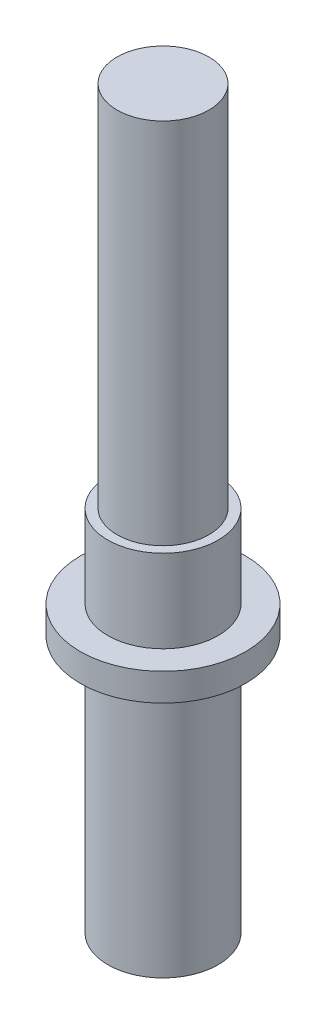
ISO-10303-21;
HEADER;
FILE_DESCRIPTION(('STEP AP214'),'2;1');
FILE_NAME('part.step','',(''),(''),'','','');
FILE_SCHEMA(('AUTOMOTIVE_DESIGN { 1 0 10303 214 1 1 1 1 }'));
ENDSEC;
DATA;
#1=APPLICATION_CONTEXT('core data for automotive mechanical design processes');
#2=APPLICATION_PROTOCOL_DEFINITION('international standard','automotive_design',2000,#1);
#3=PRODUCT_CONTEXT('',#1,'mechanical');
#4=PRODUCT('Part','Part','',(#3));
#5=PRODUCT_RELATED_PRODUCT_CATEGORY('part','',(#4));
#6=PRODUCT_DEFINITION_FORMATION('','',#4);
#7=PRODUCT_DEFINITION_CONTEXT('part definition',#1,'design');
#8=PRODUCT_DEFINITION('design','',#6,#7);
#9=PRODUCT_DEFINITION_SHAPE('','',#8);
#10=(LENGTH_UNIT() NAMED_UNIT(*) SI_UNIT(.MILLI.,.METRE.));
#11=(NAMED_UNIT(*) PLANE_ANGLE_UNIT() SI_UNIT($,.RADIAN.));
#12=(NAMED_UNIT(*) SI_UNIT($,.STERADIAN.) SOLID_ANGLE_UNIT());
#13=UNCERTAINTY_MEASURE_WITH_UNIT(LENGTH_MEASURE(1.E-05),#10,'distance_accuracy_value','');
#14=(GEOMETRIC_REPRESENTATION_CONTEXT(3) GLOBAL_UNCERTAINTY_ASSIGNED_CONTEXT((#13)) GLOBAL_UNIT_ASSIGNED_CONTEXT((#10,
#11,#12)) REPRESENTATION_CONTEXT('',''));
#15=CARTESIAN_POINT('',(0.,0.,0.));
#16=DIRECTION('',(0.,0.,1.));
#17=DIRECTION('',(1.,0.,0.));
#18=AXIS2_PLACEMENT_3D('',#15,#16,#17);
#19=CARTESIAN_POINT('',(0.,0.,0.));
#20=DIRECTION('',(0.,-1.,0.));
#21=DIRECTION('',(0.,0.,-1.));
#22=AXIS2_PLACEMENT_3D('',#19,#20,#21);
#23=PLANE('',#22);
#24=CARTESIAN_POINT('',(0.,0.,0.));
#25=DIRECTION('',(0.,-1.,0.));
#26=DIRECTION('',(0.,0.,-1.));
#27=AXIS2_PLACEMENT_3D('',#24,#25,#26);
#28=CIRCLE('',#27,3.);
#29=CARTESIAN_POINT('',(0.,0.,-3.));
#30=VERTEX_POINT('',#29);
#31=EDGE_CURVE('E10',#30,#30,#28,.T.);
#32=ORIENTED_EDGE('',*,*,#31,.T.);
#33=EDGE_LOOP('',(#32));
#34=FACE_BOUND('',#33,.T.);
#35=ADVANCED_FACE('F30',(#34),#23,.T.);
#36=CARTESIAN_POINT('',(0.,0.,0.));
#37=DIRECTION('',(0.,-1.,0.));
#38=DIRECTION('',(0.,0.,-1.));
#39=AXIS2_PLACEMENT_3D('',#36,#37,#38);
#40=CYLINDRICAL_SURFACE('',#39,3.);
#41=CARTESIAN_POINT('',(0.,14.,0.));
#42=DIRECTION('',(0.,-1.,0.));
#43=DIRECTION('',(0.,0.,-1.));
#44=AXIS2_PLACEMENT_3D('',#41,#42,#43);
#45=CIRCLE('',#44,3.);
#46=CARTESIAN_POINT('',(0.,14.,-3.));
#47=VERTEX_POINT('',#46);
#48=EDGE_CURVE('E36',#47,#47,#45,.T.);
#49=ORIENTED_EDGE('',*,*,#48,.T.);
#50=EDGE_LOOP('',(#49));
#51=FACE_BOUND('',#50,.T.);
#52=ORIENTED_EDGE('',*,*,#31,.F.);
#53=EDGE_LOOP('',(#52));
#54=FACE_BOUND('',#53,.T.);
#55=ADVANCED_FACE('F74',(#51,#54),#40,.T.);
#56=CARTESIAN_POINT('',(3.,14.,0.));
#57=DIRECTION('',(0.,-1.,0.));
#58=DIRECTION('',(0.,0.,-1.));
#59=AXIS2_PLACEMENT_3D('',#56,#57,#58);
#60=PLANE('',#59);
#61=CARTESIAN_POINT('',(0.,14.,0.));
#62=DIRECTION('',(0.,-1.,0.));
#63=DIRECTION('',(0.,0.,-1.));
#64=AXIS2_PLACEMENT_3D('',#61,#62,#63);
#65=CIRCLE('',#64,4.5);
#66=CARTESIAN_POINT('',(0.,14.,-4.5));
#67=VERTEX_POINT('',#66);
#68=EDGE_CURVE('E40',#67,#67,#65,.T.);
#69=ORIENTED_EDGE('',*,*,#68,.T.);
#70=EDGE_LOOP('',(#69));
#71=FACE_BOUND('',#70,.T.);
#72=ORIENTED_EDGE('',*,*,#48,.F.);
#73=EDGE_LOOP('',(#72));
#74=FACE_BOUND('',#73,.T.);
#75=ADVANCED_FACE('F78',(#71,#74),#60,.T.);
#76=CARTESIAN_POINT('',(0.,0.,0.));
#77=DIRECTION('',(0.,-1.,0.));
#78=DIRECTION('',(0.,0.,-1.));
#79=AXIS2_PLACEMENT_3D('',#76,#77,#78);
#80=CYLINDRICAL_SURFACE('',#79,4.5);
#81=CARTESIAN_POINT('',(0.,15.5,0.));
#82=DIRECTION('',(0.,-1.,0.));
#83=DIRECTION('',(0.,0.,-1.));
#84=AXIS2_PLACEMENT_3D('',#81,#82,#83);
#85=CIRCLE('',#84,4.5);
#86=CARTESIAN_POINT('',(0.,15.5,-4.5));
#87=VERTEX_POINT('',#86);
#88=EDGE_CURVE('E44',#87,#87,#85,.T.);
#89=ORIENTED_EDGE('',*,*,#88,.T.);
#90=EDGE_LOOP('',(#89));
#91=FACE_BOUND('',#90,.T.);
#92=ORIENTED_EDGE('',*,*,#68,.F.);
#93=EDGE_LOOP('',(#92));
#94=FACE_BOUND('',#93,.T.);
#95=ADVANCED_FACE('F82',(#91,#94),#80,.T.);
#96=CARTESIAN_POINT('',(4.5,15.5,0.));
#97=DIRECTION('',(0.,1.,0.));
#98=DIRECTION('',(0.,0.,1.));
#99=AXIS2_PLACEMENT_3D('',#96,#97,#98);
#100=PLANE('',#99);
#101=CARTESIAN_POINT('',(0.,15.5,0.));
#102=DIRECTION('',(0.,-1.,0.));
#103=DIRECTION('',(0.,0.,-1.));
#104=AXIS2_PLACEMENT_3D('',#101,#102,#103);
#105=CIRCLE('',#104,3.);
#106=CARTESIAN_POINT('',(0.,15.5,-3.));
#107=VERTEX_POINT('',#106);
#108=EDGE_CURVE('E49',#107,#107,#105,.T.);
#109=ORIENTED_EDGE('',*,*,#108,.T.);
#110=EDGE_LOOP('',(#109));
#111=FACE_BOUND('',#110,.T.);
#112=ORIENTED_EDGE('',*,*,#88,.F.);
#113=EDGE_LOOP('',(#112));
#114=FACE_BOUND('',#113,.T.);
#115=ADVANCED_FACE('F89',(#111,#114),#100,.T.);
#116=CARTESIAN_POINT('',(0.,0.,0.));
#117=DIRECTION('',(0.,-1.,0.));
#118=DIRECTION('',(0.,0.,-1.));
#119=AXIS2_PLACEMENT_3D('',#116,#117,#118);
#120=CYLINDRICAL_SURFACE('',#119,3.);
#121=CARTESIAN_POINT('',(0.,20.,0.));
#122=DIRECTION('',(0.,-1.,0.));
#123=DIRECTION('',(0.,0.,-1.));
#124=AXIS2_PLACEMENT_3D('',#121,#122,#123);
#125=CIRCLE('',#124,3.);
#126=CARTESIAN_POINT('',(0.,20.,-3.));
#127=VERTEX_POINT('',#126);
#128=EDGE_CURVE('E52',#127,#127,#125,.T.);
#129=ORIENTED_EDGE('',*,*,#128,.T.);
#130=EDGE_LOOP('',(#129));
#131=FACE_BOUND('',#130,.T.);
#132=ORIENTED_EDGE('',*,*,#108,.F.);
#133=EDGE_LOOP('',(#132));
#134=FACE_BOUND('',#133,.T.);
#135=ADVANCED_FACE('F93',(#131,#134),#120,.T.);
#136=CARTESIAN_POINT('',(3.,20.,0.));
#137=DIRECTION('',(0.,1.,0.));
#138=DIRECTION('',(0.,0.,1.));
#139=AXIS2_PLACEMENT_3D('',#136,#137,#138);
#140=PLANE('',#139);
#141=CARTESIAN_POINT('',(0.,20.,0.));
#142=DIRECTION('',(0.,-1.,0.));
#143=DIRECTION('',(0.,0.,-1.));
#144=AXIS2_PLACEMENT_3D('',#141,#142,#143);
#145=CIRCLE('',#144,2.5);
#146=CARTESIAN_POINT('',(0.,20.,-2.5));
#147=VERTEX_POINT('',#146);
#148=EDGE_CURVE('E55',#147,#147,#145,.T.);
#149=ORIENTED_EDGE('',*,*,#148,.T.);
#150=EDGE_LOOP('',(#149));
#151=FACE_BOUND('',#150,.T.);
#152=ORIENTED_EDGE('',*,*,#128,.F.);
#153=EDGE_LOOP('',(#152));
#154=FACE_BOUND('',#153,.T.);
#155=ADVANCED_FACE('F71',(#151,#154),#140,.T.);
#156=CARTESIAN_POINT('',(0.,0.,0.));
#157=DIRECTION('',(0.,-1.,0.));
#158=DIRECTION('',(0.,0.,-1.));
#159=AXIS2_PLACEMENT_3D('',#156,#157,#158);
#160=CYLINDRICAL_SURFACE('',#159,2.5);
#161=CARTESIAN_POINT('',(0.,40.,0.));
#162=DIRECTION('',(0.,-1.,0.));
#163=DIRECTION('',(0.,0.,-1.));
#164=AXIS2_PLACEMENT_3D('',#161,#162,#163);
#165=CIRCLE('',#164,2.5);
#166=CARTESIAN_POINT('',(0.,40.,-2.5));
#167=VERTEX_POINT('',#166);
#168=EDGE_CURVE('E58',#167,#167,#165,.T.);
#169=ORIENTED_EDGE('',*,*,#168,.T.);
#170=EDGE_LOOP('',(#169));
#171=FACE_BOUND('',#170,.T.);
#172=ORIENTED_EDGE('',*,*,#148,.F.);
#173=EDGE_LOOP('',(#172));
#174=FACE_BOUND('',#173,.T.);
#175=ADVANCED_FACE('F62',(#171,#174),#160,.T.);
#176=CARTESIAN_POINT('',(2.5,40.,0.));
#177=DIRECTION('',(0.,1.,0.));
#178=DIRECTION('',(0.,0.,1.));
#179=AXIS2_PLACEMENT_3D('',#176,#177,#178);
#180=PLANE('',#179);
#181=ORIENTED_EDGE('',*,*,#168,.F.);
#182=EDGE_LOOP('',(#181));
#183=FACE_BOUND('',#182,.T.);
#184=ADVANCED_FACE('F65',(#183),#180,.T.);
#185=CLOSED_SHELL('',(#35,#55,#75,#95,#115,#135,#155,#175,#184));
#186=MANIFOLD_SOLID_BREP('B2',#185);
#187=ADVANCED_BREP_SHAPE_REPRESENTATION('',(#18,#186),#14);
#188=SHAPE_DEFINITION_REPRESENTATION(#9,#187);
ENDSEC;
END-ISO-10303-21;
